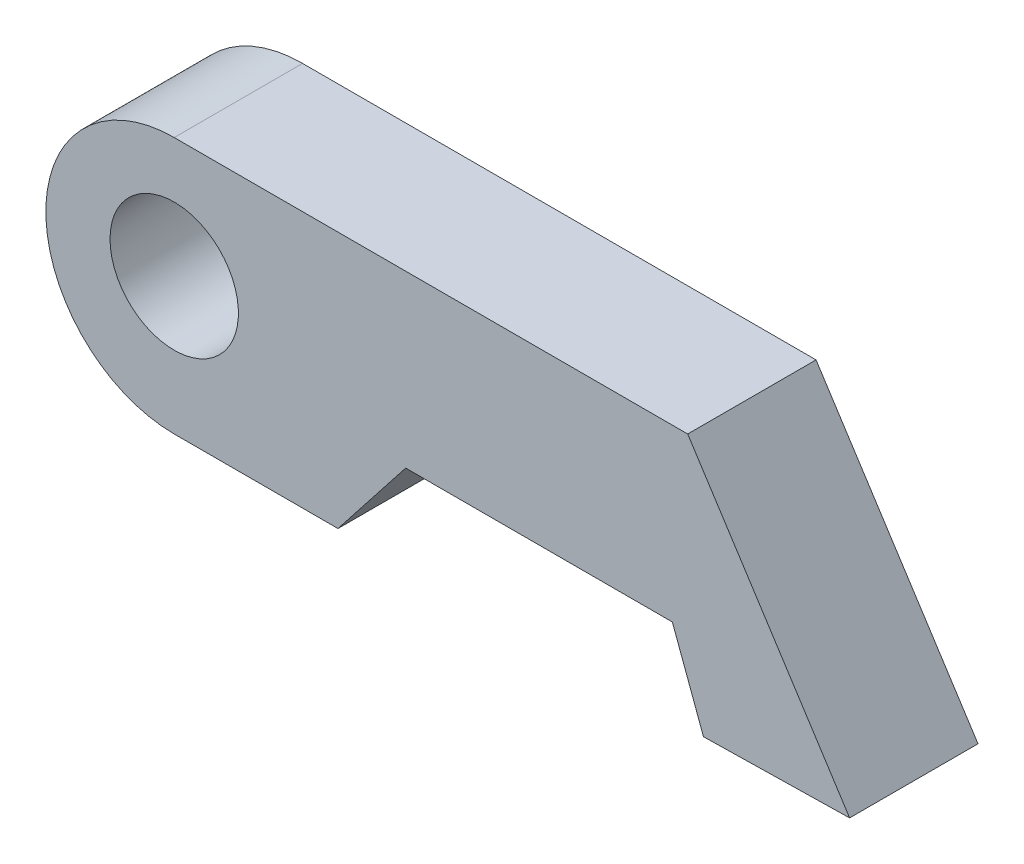
ISO-10303-21;
HEADER;
FILE_DESCRIPTION(('STEP AP214'),'2;1');
FILE_NAME('part.step','',(''),(''),'','','');
FILE_SCHEMA(('AUTOMOTIVE_DESIGN { 1 0 10303 214 1 1 1 1 }'));
ENDSEC;
DATA;
#1=APPLICATION_CONTEXT('core data for automotive mechanical design processes');
#2=APPLICATION_PROTOCOL_DEFINITION('international standard','automotive_design',2000,#1);
#3=PRODUCT_CONTEXT('',#1,'mechanical');
#4=PRODUCT('Part','Part','',(#3));
#5=PRODUCT_RELATED_PRODUCT_CATEGORY('part','',(#4));
#6=PRODUCT_DEFINITION_FORMATION('','',#4);
#7=PRODUCT_DEFINITION_CONTEXT('part definition',#1,'design');
#8=PRODUCT_DEFINITION('design','',#6,#7);
#9=PRODUCT_DEFINITION_SHAPE('','',#8);
#10=(LENGTH_UNIT() NAMED_UNIT(*) SI_UNIT(.MILLI.,.METRE.));
#11=(NAMED_UNIT(*) PLANE_ANGLE_UNIT() SI_UNIT($,.RADIAN.));
#12=(NAMED_UNIT(*) SI_UNIT($,.STERADIAN.) SOLID_ANGLE_UNIT());
#13=UNCERTAINTY_MEASURE_WITH_UNIT(LENGTH_MEASURE(1.E-05),#10,'distance_accuracy_value','');
#14=(GEOMETRIC_REPRESENTATION_CONTEXT(3) GLOBAL_UNCERTAINTY_ASSIGNED_CONTEXT((#13)) GLOBAL_UNIT_ASSIGNED_CONTEXT((#10,
#11,#12)) REPRESENTATION_CONTEXT('',''));
#15=CARTESIAN_POINT('',(0.,0.,0.));
#16=DIRECTION('',(0.,0.,1.));
#17=DIRECTION('',(1.,0.,0.));
#18=AXIS2_PLACEMENT_3D('',#15,#16,#17);
#19=CARTESIAN_POINT('',(0.,5.,5.));
#20=DIRECTION('',(0.,0.,-1.));
#21=DIRECTION('',(-1.,0.,0.));
#22=AXIS2_PLACEMENT_3D('',#19,#20,#21);
#23=CYLINDRICAL_SURFACE('',#22,5.);
#24=CARTESIAN_POINT('',(0.,5.,0.));
#25=DIRECTION('',(0.,0.,1.));
#26=DIRECTION('',(1.,0.,0.));
#27=AXIS2_PLACEMENT_3D('',#24,#25,#26);
#28=CIRCLE('',#27,5.);
#29=CARTESIAN_POINT('',(0.,10.,0.));
#30=VERTEX_POINT('',#29);
#31=CARTESIAN_POINT('',(0.,0.,0.));
#32=VERTEX_POINT('',#31);
#33=EDGE_CURVE('E125',#30,#32,#28,.T.);
#34=ORIENTED_EDGE('',*,*,#33,.T.);
#35=DIRECTION('',(0.,0.,-1.));
#36=VECTOR('',#35,1.);
#37=CARTESIAN_POINT('',(0.,0.,5.));
#38=LINE('',#37,#36);
#39=CARTESIAN_POINT('',(0.,0.,5.));
#40=VERTEX_POINT('',#39);
#41=EDGE_CURVE('E108',#40,#32,#38,.T.);
#42=ORIENTED_EDGE('',*,*,#41,.F.);
#43=CARTESIAN_POINT('',(0.,5.,5.));
#44=DIRECTION('',(0.,0.,1.));
#45=DIRECTION('',(1.,0.,0.));
#46=AXIS2_PLACEMENT_3D('',#43,#44,#45);
#47=CIRCLE('',#46,5.);
#48=CARTESIAN_POINT('',(0.,10.,5.));
#49=VERTEX_POINT('',#48);
#50=EDGE_CURVE('E114',#49,#40,#47,.T.);
#51=ORIENTED_EDGE('',*,*,#50,.F.);
#52=DIRECTION('',(0.,0.,-1.));
#53=VECTOR('',#52,1.);
#54=CARTESIAN_POINT('',(0.,10.,5.));
#55=LINE('',#54,#53);
#56=EDGE_CURVE('E140',#49,#30,#55,.T.);
#57=ORIENTED_EDGE('',*,*,#56,.T.);
#58=EDGE_LOOP('',(#34,#42,#51,#57));
#59=FACE_BOUND('',#58,.T.);
#60=ADVANCED_FACE('F36',(#59),#23,.T.);
#61=CARTESIAN_POINT('',(15.5042526162893,0.,5.));
#62=DIRECTION('',(0.,1.,0.));
#63=DIRECTION('',(0.,0.,1.));
#64=AXIS2_PLACEMENT_3D('',#61,#62,#63);
#65=PLANE('',#64);
#66=DIRECTION('',(1.,0.,0.));
#67=VECTOR('',#66,1.);
#68=CARTESIAN_POINT('',(15.5042526162893,0.,0.));
#69=LINE('',#68,#67);
#70=CARTESIAN_POINT('',(6.37912873818891,0.,0.));
#71=VERTEX_POINT('',#70);
#72=EDGE_CURVE('E40',#32,#71,#69,.T.);
#73=ORIENTED_EDGE('',*,*,#72,.T.);
#74=DIRECTION('',(0.,0.,1.));
#75=VECTOR('',#74,1.);
#76=CARTESIAN_POINT('',(6.37912873818891,0.,5.));
#77=LINE('',#76,#75);
#78=CARTESIAN_POINT('',(6.37912873818891,0.,5.));
#79=VERTEX_POINT('',#78);
#80=EDGE_CURVE('E110',#71,#79,#77,.T.);
#81=ORIENTED_EDGE('',*,*,#80,.T.);
#82=DIRECTION('',(1.,0.,0.));
#83=VECTOR('',#82,1.);
#84=CARTESIAN_POINT('',(15.5042526162893,0.,5.));
#85=LINE('',#84,#83);
#86=EDGE_CURVE('E104',#40,#79,#85,.T.);
#87=ORIENTED_EDGE('',*,*,#86,.F.);
#88=ORIENTED_EDGE('',*,*,#41,.T.);
#89=EDGE_LOOP('',(#73,#81,#87,#88));
#90=FACE_BOUND('',#89,.T.);
#91=ADVANCED_FACE('F38',(#90),#65,.F.);
#92=CARTESIAN_POINT('',(26.3074664786389,0.203296745943826,5.));
#93=DIRECTION('',(-0.0188148417684185,0.999822985197494,0.));
#94=DIRECTION('',(-0.999822985197495,-0.0188148417684185,0.));
#95=AXIS2_PLACEMENT_3D('',#92,#93,#94);
#96=PLANE('',#95);
#97=DIRECTION('',(0.999822985197494,0.0188148417684185,0.));
#98=VECTOR('',#97,1.);
#99=CARTESIAN_POINT('',(26.3074664786389,0.203296745943826,5.));
#100=LINE('',#99,#98);
#101=CARTESIAN_POINT('',(20.6148893690698,0.096172845856744,5.));
#102=VERTEX_POINT('',#101);
#103=CARTESIAN_POINT('',(26.3074664786389,0.203296745943826,5.));
#104=VERTEX_POINT('',#103);
#105=EDGE_CURVE('E139',#102,#104,#100,.T.);
#106=ORIENTED_EDGE('',*,*,#105,.F.);
#107=DIRECTION('',(0.,0.,-1.));
#108=VECTOR('',#107,1.);
#109=CARTESIAN_POINT('',(20.6148893690698,0.0961728458567441,5.));
#110=LINE('',#109,#108);
#111=CARTESIAN_POINT('',(20.6148893690698,0.096172845856744,0.));
#112=VERTEX_POINT('',#111);
#113=EDGE_CURVE('E75',#102,#112,#110,.T.);
#114=ORIENTED_EDGE('',*,*,#113,.T.);
#115=DIRECTION('',(0.999822985197494,0.0188148417684185,0.));
#116=VECTOR('',#115,1.);
#117=CARTESIAN_POINT('',(26.3074664786389,0.203296745943826,0.));
#118=LINE('',#117,#116);
#119=CARTESIAN_POINT('',(26.3074664786389,0.203296745943826,0.));
#120=VERTEX_POINT('',#119);
#121=EDGE_CURVE('E127',#112,#120,#118,.T.);
#122=ORIENTED_EDGE('',*,*,#121,.T.);
#123=DIRECTION('',(0.,0.,-1.));
#124=VECTOR('',#123,1.);
#125=CARTESIAN_POINT('',(26.3074664786389,0.203296745943826,5.));
#126=LINE('',#125,#124);
#127=EDGE_CURVE('E131',#104,#120,#126,.T.);
#128=ORIENTED_EDGE('',*,*,#127,.F.);
#129=EDGE_LOOP('',(#106,#114,#122,#128));
#130=FACE_BOUND('',#129,.T.);
#131=ADVANCED_FACE('F167',(#130),#96,.F.);
#132=CARTESIAN_POINT('',(20.,10.,5.));
#133=DIRECTION('',(-0.840804047330231,-0.541339592116725,0.));
#134=DIRECTION('',(0.541339592116725,-0.840804047330231,0.));
#135=AXIS2_PLACEMENT_3D('',#132,#133,#134);
#136=PLANE('',#135);
#137=DIRECTION('',(-0.541339592116725,0.840804047330231,0.));
#138=VECTOR('',#137,1.);
#139=CARTESIAN_POINT('',(20.,10.,0.));
#140=LINE('',#139,#138);
#141=CARTESIAN_POINT('',(20.,10.,0.));
#142=VERTEX_POINT('',#141);
#143=EDGE_CURVE('E135',#120,#142,#140,.T.);
#144=ORIENTED_EDGE('',*,*,#143,.T.);
#145=DIRECTION('',(0.,0.,-1.));
#146=VECTOR('',#145,1.);
#147=CARTESIAN_POINT('',(20.,10.,5.));
#148=LINE('',#147,#146);
#149=CARTESIAN_POINT('',(20.,10.,5.));
#150=VERTEX_POINT('',#149);
#151=EDGE_CURVE('E136',#150,#142,#148,.T.);
#152=ORIENTED_EDGE('',*,*,#151,.F.);
#153=DIRECTION('',(-0.541339592116725,0.840804047330231,0.));
#154=VECTOR('',#153,1.);
#155=CARTESIAN_POINT('',(20.,10.,5.));
#156=LINE('',#155,#154);
#157=EDGE_CURVE('E147',#104,#150,#156,.T.);
#158=ORIENTED_EDGE('',*,*,#157,.F.);
#159=ORIENTED_EDGE('',*,*,#127,.T.);
#160=EDGE_LOOP('',(#144,#152,#158,#159));
#161=FACE_BOUND('',#160,.T.);
#162=ADVANCED_FACE('F172',(#161),#136,.F.);
#163=CARTESIAN_POINT('',(0.,10.,5.));
#164=DIRECTION('',(0.,-1.,0.));
#165=DIRECTION('',(0.,0.,-1.));
#166=AXIS2_PLACEMENT_3D('',#163,#164,#165);
#167=PLANE('',#166);
#168=DIRECTION('',(-1.,0.,0.));
#169=VECTOR('',#168,1.);
#170=CARTESIAN_POINT('',(0.,10.,0.));
#171=LINE('',#170,#169);
#172=EDGE_CURVE('E134',#142,#30,#171,.T.);
#173=ORIENTED_EDGE('',*,*,#172,.T.);
#174=ORIENTED_EDGE('',*,*,#56,.F.);
#175=DIRECTION('',(-1.,0.,0.));
#176=VECTOR('',#175,1.);
#177=CARTESIAN_POINT('',(0.,10.,5.));
#178=LINE('',#177,#176);
#179=EDGE_CURVE('E119',#150,#49,#178,.T.);
#180=ORIENTED_EDGE('',*,*,#179,.F.);
#181=ORIENTED_EDGE('',*,*,#151,.T.);
#182=EDGE_LOOP('',(#173,#174,#180,#181));
#183=FACE_BOUND('',#182,.T.);
#184=ADVANCED_FACE('F177',(#183),#167,.F.);
#185=CARTESIAN_POINT('',(0.,5.,5.));
#186=DIRECTION('',(0.,0.,1.));
#187=DIRECTION('',(1.,0.,0.));
#188=AXIS2_PLACEMENT_3D('',#185,#186,#187);
#189=PLANE('',#188);
#190=CARTESIAN_POINT('',(0.,5.32494667562588,5.));
#191=DIRECTION('',(0.,0.,-1.));
#192=DIRECTION('',(-1.,0.,0.));
#193=AXIS2_PLACEMENT_3D('',#190,#191,#192);
#194=CIRCLE('',#193,2.5);
#195=CARTESIAN_POINT('',(-2.5,5.32494667562588,5.));
#196=VERTEX_POINT('',#195);
#197=EDGE_CURVE('E145',#196,#196,#194,.T.);
#198=ORIENTED_EDGE('',*,*,#197,.T.);
#199=EDGE_LOOP('',(#198));
#200=FACE_BOUND('',#199,.T.);
#201=DIRECTION('',(-0.617472505998933,-0.786592463945211,0.));
#202=VECTOR('',#201,1.);
#203=CARTESIAN_POINT('',(6.37912873818891,0.,5.));
#204=LINE('',#203,#202);
#205=CARTESIAN_POINT('',(9.01615630669994,3.35928481422965,5.));
#206=VERTEX_POINT('',#205);
#207=EDGE_CURVE('E46',#206,#79,#204,.T.);
#208=ORIENTED_EDGE('',*,*,#207,.F.);
#209=DIRECTION('',(-1.,0.,0.));
#210=VECTOR('',#209,1.);
#211=CARTESIAN_POINT('',(9.01615630669994,3.35928481422965,5.));
#212=LINE('',#211,#210);
#213=CARTESIAN_POINT('',(19.4029630428361,3.35928481422965,5.));
#214=VERTEX_POINT('',#213);
#215=EDGE_CURVE('E150',#214,#206,#212,.T.);
#216=ORIENTED_EDGE('',*,*,#215,.F.);
#217=DIRECTION('',(-0.3481646441473,0.937433400602829,0.));
#218=VECTOR('',#217,1.);
#219=CARTESIAN_POINT('',(19.4029630428361,3.35928481422965,5.));
#220=LINE('',#219,#218);
#221=EDGE_CURVE('E154',#102,#214,#220,.T.);
#222=ORIENTED_EDGE('',*,*,#221,.F.);
#223=ORIENTED_EDGE('',*,*,#105,.T.);
#224=ORIENTED_EDGE('',*,*,#157,.T.);
#225=ORIENTED_EDGE('',*,*,#179,.T.);
#226=ORIENTED_EDGE('',*,*,#50,.T.);
#227=ORIENTED_EDGE('',*,*,#86,.T.);
#228=EDGE_LOOP('',(#208,#216,#222,#223,#224,#225,#226,#227));
#229=FACE_BOUND('',#228,.T.);
#230=ADVANCED_FACE('F117',(#200,#229),#189,.T.);
#231=CARTESIAN_POINT('',(0.,5.,0.));
#232=DIRECTION('',(0.,0.,1.));
#233=DIRECTION('',(1.,0.,0.));
#234=AXIS2_PLACEMENT_3D('',#231,#232,#233);
#235=PLANE('',#234);
#236=CARTESIAN_POINT('',(0.,5.32494667562588,0.));
#237=DIRECTION('',(0.,0.,-1.));
#238=DIRECTION('',(-1.,0.,0.));
#239=AXIS2_PLACEMENT_3D('',#236,#237,#238);
#240=CIRCLE('',#239,2.5);
#241=CARTESIAN_POINT('',(-2.5,5.32494667562588,0.));
#242=VERTEX_POINT('',#241);
#243=EDGE_CURVE('E208',#242,#242,#240,.T.);
#244=ORIENTED_EDGE('',*,*,#243,.F.);
#245=EDGE_LOOP('',(#244));
#246=FACE_BOUND('',#245,.T.);
#247=DIRECTION('',(-1.,0.,0.));
#248=VECTOR('',#247,1.);
#249=CARTESIAN_POINT('',(9.01615630669994,3.35928481422965,0.));
#250=LINE('',#249,#248);
#251=CARTESIAN_POINT('',(19.4029630428361,3.35928481422965,0.));
#252=VERTEX_POINT('',#251);
#253=CARTESIAN_POINT('',(9.01615630669994,3.35928481422965,0.));
#254=VERTEX_POINT('',#253);
#255=EDGE_CURVE('E113',#252,#254,#250,.T.);
#256=ORIENTED_EDGE('',*,*,#255,.T.);
#257=DIRECTION('',(-0.617472505998933,-0.786592463945211,0.));
#258=VECTOR('',#257,1.);
#259=CARTESIAN_POINT('',(6.37912873818891,0.,0.));
#260=LINE('',#259,#258);
#261=EDGE_CURVE('E157',#254,#71,#260,.T.);
#262=ORIENTED_EDGE('',*,*,#261,.T.);
#263=ORIENTED_EDGE('',*,*,#72,.F.);
#264=ORIENTED_EDGE('',*,*,#33,.F.);
#265=ORIENTED_EDGE('',*,*,#172,.F.);
#266=ORIENTED_EDGE('',*,*,#143,.F.);
#267=ORIENTED_EDGE('',*,*,#121,.F.);
#268=DIRECTION('',(-0.3481646441473,0.937433400602829,0.));
#269=VECTOR('',#268,1.);
#270=CARTESIAN_POINT('',(19.4029630428361,3.35928481422965,0.));
#271=LINE('',#270,#269);
#272=EDGE_CURVE('E156',#112,#252,#271,.T.);
#273=ORIENTED_EDGE('',*,*,#272,.T.);
#274=EDGE_LOOP('',(#256,#262,#263,#264,#265,#266,#267,#273));
#275=FACE_BOUND('',#274,.T.);
#276=ADVANCED_FACE('F175',(#246,#275),#235,.F.);
#277=CARTESIAN_POINT('',(19.4029630428361,3.35928481422965,0.));
#278=DIRECTION('',(0.937433400602829,0.3481646441473,0.));
#279=DIRECTION('',(-0.3481646441473,0.937433400602829,0.));
#280=AXIS2_PLACEMENT_3D('',#277,#278,#279);
#281=PLANE('',#280);
#282=ORIENTED_EDGE('',*,*,#221,.T.);
#283=DIRECTION('',(0.,0.,1.));
#284=VECTOR('',#283,1.);
#285=CARTESIAN_POINT('',(19.4029630428361,3.35928481422965,0.));
#286=LINE('',#285,#284);
#287=EDGE_CURVE('E149',#252,#214,#286,.T.);
#288=ORIENTED_EDGE('',*,*,#287,.F.);
#289=ORIENTED_EDGE('',*,*,#272,.F.);
#290=ORIENTED_EDGE('',*,*,#113,.F.);
#291=EDGE_LOOP('',(#282,#288,#289,#290));
#292=FACE_BOUND('',#291,.T.);
#293=ADVANCED_FACE('F213',(#292),#281,.F.);
#294=CARTESIAN_POINT('',(9.01615630669994,3.35928481422965,0.));
#295=DIRECTION('',(0.,1.,0.));
#296=DIRECTION('',(0.,0.,1.));
#297=AXIS2_PLACEMENT_3D('',#294,#295,#296);
#298=PLANE('',#297);
#299=ORIENTED_EDGE('',*,*,#215,.T.);
#300=DIRECTION('',(0.,0.,1.));
#301=VECTOR('',#300,1.);
#302=CARTESIAN_POINT('',(9.01615630669994,3.35928481422965,0.));
#303=LINE('',#302,#301);
#304=EDGE_CURVE('E11',#254,#206,#303,.T.);
#305=ORIENTED_EDGE('',*,*,#304,.F.);
#306=ORIENTED_EDGE('',*,*,#255,.F.);
#307=ORIENTED_EDGE('',*,*,#287,.T.);
#308=EDGE_LOOP('',(#299,#305,#306,#307));
#309=FACE_BOUND('',#308,.T.);
#310=ADVANCED_FACE('F201',(#309),#298,.F.);
#311=CARTESIAN_POINT('',(6.37912873818891,0.,0.));
#312=DIRECTION('',(-0.786592463945211,0.617472505998933,0.));
#313=DIRECTION('',(-0.617472505998933,-0.786592463945211,0.));
#314=AXIS2_PLACEMENT_3D('',#311,#312,#313);
#315=PLANE('',#314);
#316=ORIENTED_EDGE('',*,*,#207,.T.);
#317=ORIENTED_EDGE('',*,*,#80,.F.);
#318=ORIENTED_EDGE('',*,*,#261,.F.);
#319=ORIENTED_EDGE('',*,*,#304,.T.);
#320=EDGE_LOOP('',(#316,#317,#318,#319));
#321=FACE_BOUND('',#320,.T.);
#322=ADVANCED_FACE('F196',(#321),#315,.F.);
#323=CARTESIAN_POINT('',(0.,5.32494667562588,5.));
#324=DIRECTION('',(0.,0.,-1.));
#325=DIRECTION('',(-1.,0.,0.));
#326=AXIS2_PLACEMENT_3D('',#323,#324,#325);
#327=CYLINDRICAL_SURFACE('',#326,2.5);
#328=ORIENTED_EDGE('',*,*,#197,.F.);
#329=EDGE_LOOP('',(#328));
#330=FACE_BOUND('',#329,.T.);
#331=ORIENTED_EDGE('',*,*,#243,.T.);
#332=EDGE_LOOP('',(#331));
#333=FACE_BOUND('',#332,.T.);
#334=ADVANCED_FACE('F194',(#330,#333),#327,.F.);
#335=CLOSED_SHELL('',(#60,#91,#131,#162,#184,#230,#276,#293,#310,#322,#334));
#336=MANIFOLD_SOLID_BREP('B2',#335);
#337=ADVANCED_BREP_SHAPE_REPRESENTATION('',(#18,#336),#14);
#338=SHAPE_DEFINITION_REPRESENTATION(#9,#337);
ENDSEC;
END-ISO-10303-21;
